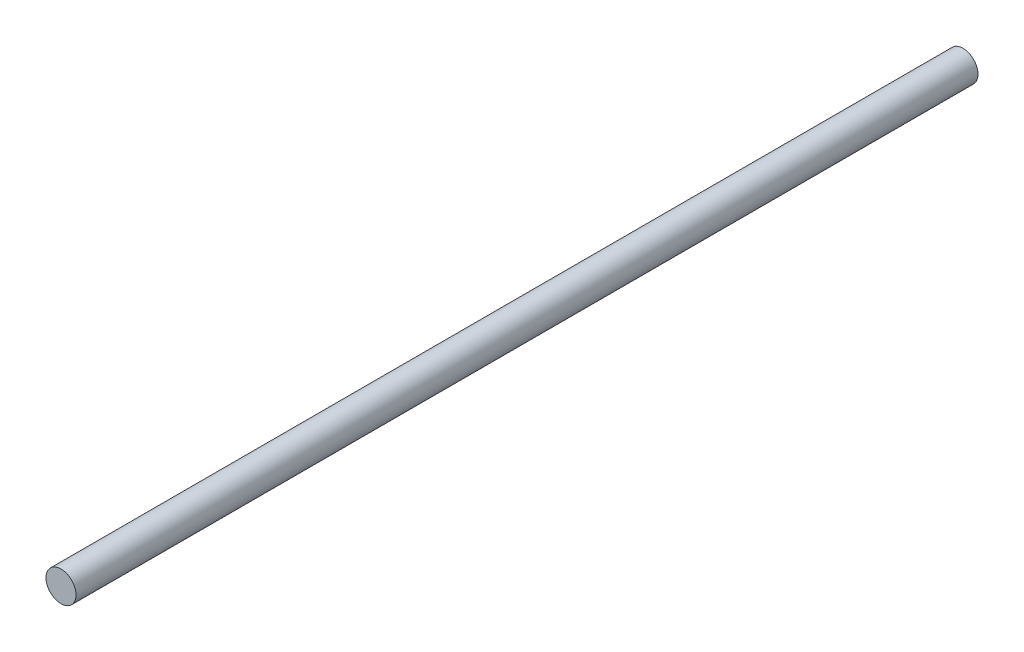
ISO-10303-21;
HEADER;
FILE_DESCRIPTION(('STEP AP214'),'2;1');
FILE_NAME('part.step','',(''),(''),'','','');
FILE_SCHEMA(('AUTOMOTIVE_DESIGN { 1 0 10303 214 1 1 1 1 }'));
ENDSEC;
DATA;
#1=APPLICATION_CONTEXT('core data for automotive mechanical design processes');
#2=APPLICATION_PROTOCOL_DEFINITION('international standard','automotive_design',2000,#1);
#3=PRODUCT_CONTEXT('',#1,'mechanical');
#4=PRODUCT('Part','Part','',(#3));
#5=PRODUCT_RELATED_PRODUCT_CATEGORY('part','',(#4));
#6=PRODUCT_DEFINITION_FORMATION('','',#4);
#7=PRODUCT_DEFINITION_CONTEXT('part definition',#1,'design');
#8=PRODUCT_DEFINITION('design','',#6,#7);
#9=PRODUCT_DEFINITION_SHAPE('','',#8);
#10=(LENGTH_UNIT() NAMED_UNIT(*) SI_UNIT(.MILLI.,.METRE.));
#11=(NAMED_UNIT(*) PLANE_ANGLE_UNIT() SI_UNIT($,.RADIAN.));
#12=(NAMED_UNIT(*) SI_UNIT($,.STERADIAN.) SOLID_ANGLE_UNIT());
#13=UNCERTAINTY_MEASURE_WITH_UNIT(LENGTH_MEASURE(1.E-05),#10,'distance_accuracy_value','');
#14=(GEOMETRIC_REPRESENTATION_CONTEXT(3) GLOBAL_UNCERTAINTY_ASSIGNED_CONTEXT((#13)) GLOBAL_UNIT_ASSIGNED_CONTEXT((#10,
#11,#12)) REPRESENTATION_CONTEXT('',''));
#15=CARTESIAN_POINT('',(0.,0.,0.));
#16=DIRECTION('',(0.,0.,1.));
#17=DIRECTION('',(1.,0.,0.));
#18=AXIS2_PLACEMENT_3D('',#15,#16,#17);
#19=CARTESIAN_POINT('',(0.,0.,190.5));
#20=DIRECTION('',(0.,0.,-1.));
#21=DIRECTION('',(-1.,0.,0.));
#22=AXIS2_PLACEMENT_3D('',#19,#20,#21);
#23=CYLINDRICAL_SURFACE('',#22,6.35);
#24=CARTESIAN_POINT('',(0.,0.,190.5));
#25=DIRECTION('',(0.,0.,1.));
#26=DIRECTION('',(1.,0.,0.));
#27=AXIS2_PLACEMENT_3D('',#24,#25,#26);
#28=CIRCLE('',#27,6.35);
#29=CARTESIAN_POINT('',(6.35,0.,190.5));
#30=VERTEX_POINT('',#29);
#31=EDGE_CURVE('E10',#30,#30,#28,.T.);
#32=ORIENTED_EDGE('',*,*,#31,.F.);
#33=EDGE_LOOP('',(#32));
#34=FACE_BOUND('',#33,.T.);
#35=CARTESIAN_POINT('',(0.,0.,-190.5));
#36=DIRECTION('',(0.,0.,1.));
#37=DIRECTION('',(1.,0.,0.));
#38=AXIS2_PLACEMENT_3D('',#35,#36,#37);
#39=CIRCLE('',#38,6.35);
#40=CARTESIAN_POINT('',(6.35,0.,-190.5));
#41=VERTEX_POINT('',#40);
#42=EDGE_CURVE('E34',#41,#41,#39,.T.);
#43=ORIENTED_EDGE('',*,*,#42,.T.);
#44=EDGE_LOOP('',(#43));
#45=FACE_BOUND('',#44,.T.);
#46=ADVANCED_FACE('F31',(#34,#45),#23,.T.);
#47=CARTESIAN_POINT('',(0.,0.,190.5));
#48=DIRECTION('',(0.,0.,1.));
#49=DIRECTION('',(1.,0.,0.));
#50=AXIS2_PLACEMENT_3D('',#47,#48,#49);
#51=PLANE('',#50);
#52=ORIENTED_EDGE('',*,*,#31,.T.);
#53=EDGE_LOOP('',(#52));
#54=FACE_BOUND('',#53,.T.);
#55=ADVANCED_FACE('F46',(#54),#51,.T.);
#56=CARTESIAN_POINT('',(0.,0.,-190.5));
#57=DIRECTION('',(0.,0.,1.));
#58=DIRECTION('',(1.,0.,0.));
#59=AXIS2_PLACEMENT_3D('',#56,#57,#58);
#60=PLANE('',#59);
#61=ORIENTED_EDGE('',*,*,#42,.F.);
#62=EDGE_LOOP('',(#61));
#63=FACE_BOUND('',#62,.T.);
#64=ADVANCED_FACE('F44',(#63),#60,.F.);
#65=CLOSED_SHELL('',(#46,#55,#64));
#66=MANIFOLD_SOLID_BREP('B2',#65);
#67=ADVANCED_BREP_SHAPE_REPRESENTATION('',(#18,#66),#14);
#68=SHAPE_DEFINITION_REPRESENTATION(#9,#67);
ENDSEC;
END-ISO-10303-21;
